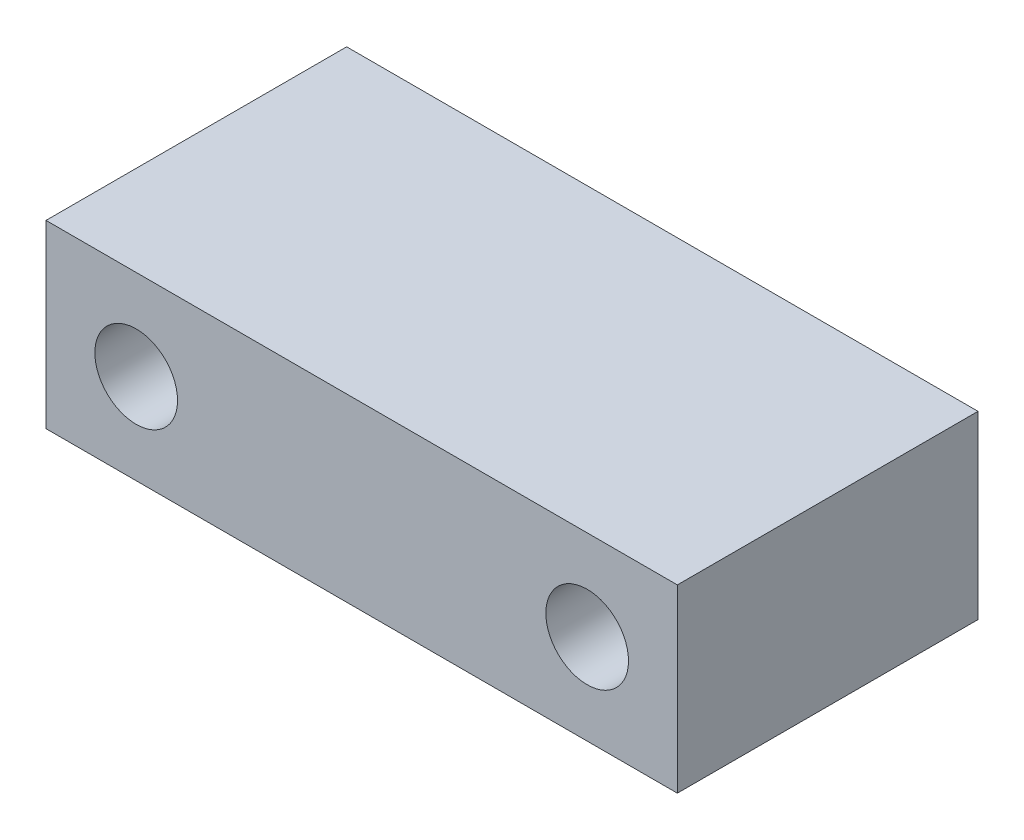
ISO-10303-21;
HEADER;
FILE_DESCRIPTION(('STEP AP214'),'2;1');
FILE_NAME('part.step','',(''),(''),'','','');
FILE_SCHEMA(('AUTOMOTIVE_DESIGN { 1 0 10303 214 1 1 1 1 }'));
ENDSEC;
DATA;
#1=APPLICATION_CONTEXT('core data for automotive mechanical design processes');
#2=APPLICATION_PROTOCOL_DEFINITION('international standard','automotive_design',2000,#1);
#3=PRODUCT_CONTEXT('',#1,'mechanical');
#4=PRODUCT('Part','Part','',(#3));
#5=PRODUCT_RELATED_PRODUCT_CATEGORY('part','',(#4));
#6=PRODUCT_DEFINITION_FORMATION('','',#4);
#7=PRODUCT_DEFINITION_CONTEXT('part definition',#1,'design');
#8=PRODUCT_DEFINITION('design','',#6,#7);
#9=PRODUCT_DEFINITION_SHAPE('','',#8);
#10=(LENGTH_UNIT() NAMED_UNIT(*) SI_UNIT(.MILLI.,.METRE.));
#11=(NAMED_UNIT(*) PLANE_ANGLE_UNIT() SI_UNIT($,.RADIAN.));
#12=(NAMED_UNIT(*) SI_UNIT($,.STERADIAN.) SOLID_ANGLE_UNIT());
#13=UNCERTAINTY_MEASURE_WITH_UNIT(LENGTH_MEASURE(1.E-05),#10,'distance_accuracy_value','');
#14=(GEOMETRIC_REPRESENTATION_CONTEXT(3) GLOBAL_UNCERTAINTY_ASSIGNED_CONTEXT((#13)) GLOBAL_UNIT_ASSIGNED_CONTEXT((#10,
#11,#12)) REPRESENTATION_CONTEXT('',''));
#15=CARTESIAN_POINT('',(0.,0.,0.));
#16=DIRECTION('',(0.,0.,1.));
#17=DIRECTION('',(1.,0.,0.));
#18=AXIS2_PLACEMENT_3D('',#15,#16,#17);
#19=CARTESIAN_POINT('',(0.,0.,20.));
#20=DIRECTION('',(0.,0.,-1.));
#21=DIRECTION('',(-1.,0.,0.));
#22=AXIS2_PLACEMENT_3D('',#19,#20,#21);
#23=PLANE('',#22);
#24=CARTESIAN_POINT('',(-15.,0.,20.));
#25=DIRECTION('',(0.,0.,1.));
#26=DIRECTION('',(1.,0.,0.));
#27=AXIS2_PLACEMENT_3D('',#24,#25,#26);
#28=CIRCLE('',#27,2.74999999999999);
#29=CARTESIAN_POINT('',(-12.25,0.,20.));
#30=VERTEX_POINT('',#29);
#31=EDGE_CURVE('E120',#30,#30,#28,.T.);
#32=ORIENTED_EDGE('',*,*,#31,.F.);
#33=EDGE_LOOP('',(#32));
#34=FACE_BOUND('',#33,.T.);
#35=DIRECTION('',(0.,1.,0.));
#36=VECTOR('',#35,1.);
#37=CARTESIAN_POINT('',(21.,-6.,20.));
#38=LINE('',#37,#36);
#39=CARTESIAN_POINT('',(21.,-6.,20.));
#40=VERTEX_POINT('',#39);
#41=CARTESIAN_POINT('',(21.,6.,20.));
#42=VERTEX_POINT('',#41);
#43=EDGE_CURVE('E86',#40,#42,#38,.T.);
#44=ORIENTED_EDGE('',*,*,#43,.T.);
#45=DIRECTION('',(-1.,0.,0.));
#46=VECTOR('',#45,1.);
#47=CARTESIAN_POINT('',(-21.,6.,20.));
#48=LINE('',#47,#46);
#49=CARTESIAN_POINT('',(-21.,6.,20.));
#50=VERTEX_POINT('',#49);
#51=EDGE_CURVE('E81',#42,#50,#48,.T.);
#52=ORIENTED_EDGE('',*,*,#51,.T.);
#53=DIRECTION('',(0.,-1.,0.));
#54=VECTOR('',#53,1.);
#55=CARTESIAN_POINT('',(-21.,-6.,20.));
#56=LINE('',#55,#54);
#57=CARTESIAN_POINT('',(-21.,-6.,20.));
#58=VERTEX_POINT('',#57);
#59=EDGE_CURVE('E84',#50,#58,#56,.T.);
#60=ORIENTED_EDGE('',*,*,#59,.T.);
#61=DIRECTION('',(1.,0.,0.));
#62=VECTOR('',#61,1.);
#63=CARTESIAN_POINT('',(-21.,-6.,20.));
#64=LINE('',#63,#62);
#65=EDGE_CURVE('E51',#58,#40,#64,.T.);
#66=ORIENTED_EDGE('',*,*,#65,.T.);
#67=EDGE_LOOP('',(#44,#52,#60,#66));
#68=FACE_BOUND('',#67,.T.);
#69=CARTESIAN_POINT('',(15.,0.,20.));
#70=DIRECTION('',(0.,0.,1.));
#71=DIRECTION('',(1.,0.,0.));
#72=AXIS2_PLACEMENT_3D('',#69,#70,#71);
#73=CIRCLE('',#72,2.74999999999999);
#74=CARTESIAN_POINT('',(17.75,0.,20.));
#75=VERTEX_POINT('',#74);
#76=EDGE_CURVE('E114',#75,#75,#73,.T.);
#77=ORIENTED_EDGE('',*,*,#76,.F.);
#78=EDGE_LOOP('',(#77));
#79=FACE_BOUND('',#78,.T.);
#80=ADVANCED_FACE('F34',(#34,#68,#79),#23,.F.);
#81=CARTESIAN_POINT('',(21.,-6.,20.));
#82=DIRECTION('',(-1.,0.,0.));
#83=DIRECTION('',(0.,0.,1.));
#84=AXIS2_PLACEMENT_3D('',#81,#82,#83);
#85=PLANE('',#84);
#86=DIRECTION('',(0.,1.,0.));
#87=VECTOR('',#86,1.);
#88=CARTESIAN_POINT('',(21.,-6.,0.));
#89=LINE('',#88,#87);
#90=CARTESIAN_POINT('',(21.,-6.,0.));
#91=VERTEX_POINT('',#90);
#92=CARTESIAN_POINT('',(21.,6.,0.));
#93=VERTEX_POINT('',#92);
#94=EDGE_CURVE('E98',#91,#93,#89,.T.);
#95=ORIENTED_EDGE('',*,*,#94,.T.);
#96=DIRECTION('',(0.,0.,-1.));
#97=VECTOR('',#96,1.);
#98=CARTESIAN_POINT('',(21.,6.,20.));
#99=LINE('',#98,#97);
#100=EDGE_CURVE('E11',#42,#93,#99,.T.);
#101=ORIENTED_EDGE('',*,*,#100,.F.);
#102=ORIENTED_EDGE('',*,*,#43,.F.);
#103=DIRECTION('',(0.,0.,-1.));
#104=VECTOR('',#103,1.);
#105=CARTESIAN_POINT('',(21.,-6.,20.));
#106=LINE('',#105,#104);
#107=EDGE_CURVE('E94',#40,#91,#106,.T.);
#108=ORIENTED_EDGE('',*,*,#107,.T.);
#109=EDGE_LOOP('',(#95,#101,#102,#108));
#110=FACE_BOUND('',#109,.T.);
#111=ADVANCED_FACE('F36',(#110),#85,.F.);
#112=CARTESIAN_POINT('',(-21.,6.,20.));
#113=DIRECTION('',(0.,-1.,0.));
#114=DIRECTION('',(0.,0.,-1.));
#115=AXIS2_PLACEMENT_3D('',#112,#113,#114);
#116=PLANE('',#115);
#117=DIRECTION('',(-1.,0.,0.));
#118=VECTOR('',#117,1.);
#119=CARTESIAN_POINT('',(-21.,6.,0.));
#120=LINE('',#119,#118);
#121=CARTESIAN_POINT('',(-21.,6.,0.));
#122=VERTEX_POINT('',#121);
#123=EDGE_CURVE('E90',#93,#122,#120,.T.);
#124=ORIENTED_EDGE('',*,*,#123,.T.);
#125=DIRECTION('',(0.,0.,-1.));
#126=VECTOR('',#125,1.);
#127=CARTESIAN_POINT('',(-21.,6.,20.));
#128=LINE('',#127,#126);
#129=EDGE_CURVE('E43',#50,#122,#128,.T.);
#130=ORIENTED_EDGE('',*,*,#129,.F.);
#131=ORIENTED_EDGE('',*,*,#51,.F.);
#132=ORIENTED_EDGE('',*,*,#100,.T.);
#133=EDGE_LOOP('',(#124,#130,#131,#132));
#134=FACE_BOUND('',#133,.T.);
#135=ADVANCED_FACE('F89',(#134),#116,.F.);
#136=CARTESIAN_POINT('',(-21.,-6.,20.));
#137=DIRECTION('',(1.,0.,0.));
#138=DIRECTION('',(0.,0.,-1.));
#139=AXIS2_PLACEMENT_3D('',#136,#137,#138);
#140=PLANE('',#139);
#141=DIRECTION('',(0.,-1.,0.));
#142=VECTOR('',#141,1.);
#143=CARTESIAN_POINT('',(-21.,-6.,0.));
#144=LINE('',#143,#142);
#145=CARTESIAN_POINT('',(-21.,-6.,0.));
#146=VERTEX_POINT('',#145);
#147=EDGE_CURVE('E68',#122,#146,#144,.T.);
#148=ORIENTED_EDGE('',*,*,#147,.T.);
#149=DIRECTION('',(0.,0.,-1.));
#150=VECTOR('',#149,1.);
#151=CARTESIAN_POINT('',(-21.,-6.,20.));
#152=LINE('',#151,#150);
#153=EDGE_CURVE('E91',#58,#146,#152,.T.);
#154=ORIENTED_EDGE('',*,*,#153,.F.);
#155=ORIENTED_EDGE('',*,*,#59,.F.);
#156=ORIENTED_EDGE('',*,*,#129,.T.);
#157=EDGE_LOOP('',(#148,#154,#155,#156));
#158=FACE_BOUND('',#157,.T.);
#159=ADVANCED_FACE('F92',(#158),#140,.F.);
#160=CARTESIAN_POINT('',(-21.,-6.,20.));
#161=DIRECTION('',(0.,1.,0.));
#162=DIRECTION('',(0.,0.,1.));
#163=AXIS2_PLACEMENT_3D('',#160,#161,#162);
#164=PLANE('',#163);
#165=DIRECTION('',(1.,0.,0.));
#166=VECTOR('',#165,1.);
#167=CARTESIAN_POINT('',(-21.,-6.,0.));
#168=LINE('',#167,#166);
#169=EDGE_CURVE('E74',#146,#91,#168,.T.);
#170=ORIENTED_EDGE('',*,*,#169,.T.);
#171=ORIENTED_EDGE('',*,*,#107,.F.);
#172=ORIENTED_EDGE('',*,*,#65,.F.);
#173=ORIENTED_EDGE('',*,*,#153,.T.);
#174=EDGE_LOOP('',(#170,#171,#172,#173));
#175=FACE_BOUND('',#174,.T.);
#176=ADVANCED_FACE('F106',(#175),#164,.F.);
#177=CARTESIAN_POINT('',(0.,0.,0.));
#178=DIRECTION('',(0.,0.,-1.));
#179=DIRECTION('',(-1.,0.,0.));
#180=AXIS2_PLACEMENT_3D('',#177,#178,#179);
#181=PLANE('',#180);
#182=CARTESIAN_POINT('',(-15.,0.,0.));
#183=DIRECTION('',(0.,0.,-1.));
#184=DIRECTION('',(-1.,0.,0.));
#185=AXIS2_PLACEMENT_3D('',#182,#183,#184);
#186=CIRCLE('',#185,2.74999999999999);
#187=CARTESIAN_POINT('',(-17.75,0.,0.));
#188=VERTEX_POINT('',#187);
#189=EDGE_CURVE('E117',#188,#188,#186,.T.);
#190=ORIENTED_EDGE('',*,*,#189,.F.);
#191=EDGE_LOOP('',(#190));
#192=FACE_BOUND('',#191,.T.);
#193=CARTESIAN_POINT('',(15.,0.,0.));
#194=DIRECTION('',(0.,0.,-1.));
#195=DIRECTION('',(-1.,0.,0.));
#196=AXIS2_PLACEMENT_3D('',#193,#194,#195);
#197=CIRCLE('',#196,2.74999999999999);
#198=CARTESIAN_POINT('',(12.25,0.,0.));
#199=VERTEX_POINT('',#198);
#200=EDGE_CURVE('E101',#199,#199,#197,.T.);
#201=ORIENTED_EDGE('',*,*,#200,.F.);
#202=EDGE_LOOP('',(#201));
#203=FACE_BOUND('',#202,.T.);
#204=ORIENTED_EDGE('',*,*,#94,.F.);
#205=ORIENTED_EDGE('',*,*,#169,.F.);
#206=ORIENTED_EDGE('',*,*,#147,.F.);
#207=ORIENTED_EDGE('',*,*,#123,.F.);
#208=EDGE_LOOP('',(#204,#205,#206,#207));
#209=FACE_BOUND('',#208,.T.);
#210=ADVANCED_FACE('F109',(#192,#203,#209),#181,.T.);
#211=CARTESIAN_POINT('',(15.,0.,20.));
#212=DIRECTION('',(0.,0.,1.));
#213=DIRECTION('',(1.,0.,0.));
#214=AXIS2_PLACEMENT_3D('',#211,#212,#213);
#215=CYLINDRICAL_SURFACE('',#214,2.74999999999999);
#216=ORIENTED_EDGE('',*,*,#76,.T.);
#217=EDGE_LOOP('',(#216));
#218=FACE_BOUND('',#217,.T.);
#219=ORIENTED_EDGE('',*,*,#200,.T.);
#220=EDGE_LOOP('',(#219));
#221=FACE_BOUND('',#220,.T.);
#222=ADVANCED_FACE('F134',(#218,#221),#215,.F.);
#223=CARTESIAN_POINT('',(-15.,0.,20.));
#224=DIRECTION('',(0.,0.,1.));
#225=DIRECTION('',(1.,0.,0.));
#226=AXIS2_PLACEMENT_3D('',#223,#224,#225);
#227=CYLINDRICAL_SURFACE('',#226,2.74999999999999);
#228=ORIENTED_EDGE('',*,*,#31,.T.);
#229=EDGE_LOOP('',(#228));
#230=FACE_BOUND('',#229,.T.);
#231=ORIENTED_EDGE('',*,*,#189,.T.);
#232=EDGE_LOOP('',(#231));
#233=FACE_BOUND('',#232,.T.);
#234=ADVANCED_FACE('F124',(#230,#233),#227,.F.);
#235=CLOSED_SHELL('',(#80,#111,#135,#159,#176,#210,#222,#234));
#236=MANIFOLD_SOLID_BREP('B2',#235);
#237=ADVANCED_BREP_SHAPE_REPRESENTATION('',(#18,#236),#14);
#238=SHAPE_DEFINITION_REPRESENTATION(#9,#237);
ENDSEC;
END-ISO-10303-21;
